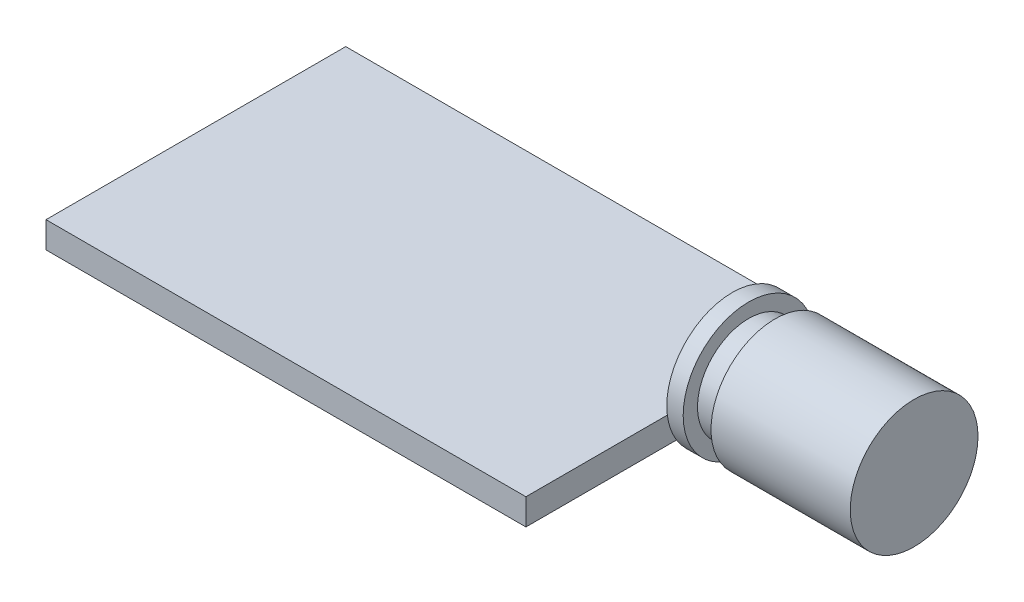
ISO-10303-21;
HEADER;
FILE_DESCRIPTION(('STEP AP214'),'2;1');
FILE_NAME('part.step','',(''),(''),'','','');
FILE_SCHEMA(('AUTOMOTIVE_DESIGN { 1 0 10303 214 1 1 1 1 }'));
ENDSEC;
DATA;
#1=APPLICATION_CONTEXT('core data for automotive mechanical design processes');
#2=APPLICATION_PROTOCOL_DEFINITION('international standard','automotive_design',2000,#1);
#3=PRODUCT_CONTEXT('',#1,'mechanical');
#4=PRODUCT('Part','Part','',(#3));
#5=PRODUCT_RELATED_PRODUCT_CATEGORY('part','',(#4));
#6=PRODUCT_DEFINITION_FORMATION('','',#4);
#7=PRODUCT_DEFINITION_CONTEXT('part definition',#1,'design');
#8=PRODUCT_DEFINITION('design','',#6,#7);
#9=PRODUCT_DEFINITION_SHAPE('','',#8);
#10=(LENGTH_UNIT() NAMED_UNIT(*) SI_UNIT(.MILLI.,.METRE.));
#11=(NAMED_UNIT(*) PLANE_ANGLE_UNIT() SI_UNIT($,.RADIAN.));
#12=(NAMED_UNIT(*) SI_UNIT($,.STERADIAN.) SOLID_ANGLE_UNIT());
#13=UNCERTAINTY_MEASURE_WITH_UNIT(LENGTH_MEASURE(1.E-05),#10,'distance_accuracy_value','');
#14=(GEOMETRIC_REPRESENTATION_CONTEXT(3) GLOBAL_UNCERTAINTY_ASSIGNED_CONTEXT((#13)) GLOBAL_UNIT_ASSIGNED_CONTEXT((#10,
#11,#12)) REPRESENTATION_CONTEXT('',''));
#15=CARTESIAN_POINT('',(0.,0.,0.));
#16=DIRECTION('',(0.,0.,1.));
#17=DIRECTION('',(1.,0.,0.));
#18=AXIS2_PLACEMENT_3D('',#15,#16,#17);
#19=CARTESIAN_POINT('',(30.3,2.1,-12.6));
#20=DIRECTION('',(1.,0.,0.));
#21=DIRECTION('',(0.,0.,-1.));
#22=AXIS2_PLACEMENT_3D('',#19,#20,#21);
#23=PLANE('',#22);
#24=CARTESIAN_POINT('',(30.3,2.1,-12.6));
#25=DIRECTION('',(1.,0.,0.));
#26=DIRECTION('',(0.,0.,-1.));
#27=AXIS2_PLACEMENT_3D('',#24,#25,#26);
#28=CIRCLE('',#27,4.);
#29=CARTESIAN_POINT('',(30.3,2.1,-16.6));
#30=VERTEX_POINT('',#29);
#31=EDGE_CURVE('E116',#30,#30,#28,.T.);
#32=ORIENTED_EDGE('',*,*,#31,.T.);
#33=EDGE_LOOP('',(#32));
#34=FACE_BOUND('',#33,.T.);
#35=CARTESIAN_POINT('',(30.3,2.1,-12.6));
#36=DIRECTION('',(1.,0.,0.));
#37=DIRECTION('',(0.,0.,-1.));
#38=AXIS2_PLACEMENT_3D('',#35,#36,#37);
#39=CIRCLE('',#38,3.125);
#40=CARTESIAN_POINT('',(30.3,2.1,-15.725));
#41=VERTEX_POINT('',#40);
#42=EDGE_CURVE('E274',#41,#41,#39,.T.);
#43=ORIENTED_EDGE('',*,*,#42,.F.);
#44=EDGE_LOOP('',(#43));
#45=FACE_BOUND('',#44,.T.);
#46=ADVANCED_FACE('F37',(#34,#45),#23,.T.);
#47=CARTESIAN_POINT('',(29.3,1.6,0.));
#48=DIRECTION('',(-1.,0.,0.));
#49=DIRECTION('',(0.,0.,1.));
#50=AXIS2_PLACEMENT_3D('',#47,#48,#49);
#51=PLANE('',#50);
#52=CARTESIAN_POINT('',(29.3,2.1,-12.6));
#53=DIRECTION('',(1.,0.,0.));
#54=DIRECTION('',(0.,0.,-1.));
#55=AXIS2_PLACEMENT_3D('',#52,#53,#54);
#56=CIRCLE('',#55,4.);
#57=CARTESIAN_POINT('',(29.3,1.6,-8.63137303340311));
#58=VERTEX_POINT('',#57);
#59=CARTESIAN_POINT('',(29.3,0.,-9.19559109389016));
#60=VERTEX_POINT('',#59);
#61=EDGE_CURVE('E47',#58,#60,#56,.T.);
#62=ORIENTED_EDGE('',*,*,#61,.F.);
#63=DIRECTION('',(0.,0.,-1.));
#64=VECTOR('',#63,1.);
#65=CARTESIAN_POINT('',(29.3,1.6,0.));
#66=LINE('',#65,#64);
#67=CARTESIAN_POINT('',(29.3,1.6,0.));
#68=VERTEX_POINT('',#67);
#69=EDGE_CURVE('E97',#68,#58,#66,.T.);
#70=ORIENTED_EDGE('',*,*,#69,.F.);
#71=DIRECTION('',(0.,-1.,0.));
#72=VECTOR('',#71,1.);
#73=CARTESIAN_POINT('',(29.3,1.6,0.));
#74=LINE('',#73,#72);
#75=CARTESIAN_POINT('',(29.3,0.,0.));
#76=VERTEX_POINT('',#75);
#77=EDGE_CURVE('E139',#68,#76,#74,.T.);
#78=ORIENTED_EDGE('',*,*,#77,.T.);
#79=DIRECTION('',(0.,0.,-1.));
#80=VECTOR('',#79,1.);
#81=CARTESIAN_POINT('',(29.3,0.,0.));
#82=LINE('',#81,#80);
#83=EDGE_CURVE('E133',#76,#60,#82,.T.);
#84=ORIENTED_EDGE('',*,*,#83,.T.);
#85=EDGE_LOOP('',(#62,#70,#78,#84));
#86=FACE_BOUND('',#85,.T.);
#87=ADVANCED_FACE('F154',(#86),#51,.F.);
#88=CARTESIAN_POINT('',(29.3,0.,-16.0044089061098));
#89=VERTEX_POINT('',#88);
#90=CARTESIAN_POINT('',(29.3,1.6,-16.5686269665969));
#91=VERTEX_POINT('',#90);
#92=EDGE_CURVE('E11',#89,#91,#56,.T.);
#93=ORIENTED_EDGE('',*,*,#92,.F.);
#94=CARTESIAN_POINT('',(29.3,0.,-18.3));
#95=VERTEX_POINT('',#94);
#96=EDGE_CURVE('E132',#89,#95,#82,.T.);
#97=ORIENTED_EDGE('',*,*,#96,.T.);
#98=DIRECTION('',(0.,-1.,0.));
#99=VECTOR('',#98,1.);
#100=CARTESIAN_POINT('',(29.3,1.6,-18.3));
#101=LINE('',#100,#99);
#102=CARTESIAN_POINT('',(29.3,1.6,-18.3));
#103=VERTEX_POINT('',#102);
#104=EDGE_CURVE('E104',#103,#95,#101,.T.);
#105=ORIENTED_EDGE('',*,*,#104,.F.);
#106=EDGE_CURVE('E95',#91,#103,#66,.T.);
#107=ORIENTED_EDGE('',*,*,#106,.F.);
#108=EDGE_LOOP('',(#93,#97,#105,#107));
#109=FACE_BOUND('',#108,.T.);
#110=ADVANCED_FACE('F102',(#109),#51,.F.);
#111=CARTESIAN_POINT('',(0.,1.6,0.));
#112=DIRECTION('',(1.,0.,0.));
#113=DIRECTION('',(0.,0.,-1.));
#114=AXIS2_PLACEMENT_3D('',#111,#112,#113);
#115=PLANE('',#114);
#116=DIRECTION('',(0.,0.,1.));
#117=VECTOR('',#116,1.);
#118=CARTESIAN_POINT('',(0.,0.,0.));
#119=LINE('',#118,#117);
#120=CARTESIAN_POINT('',(0.,0.,-18.3));
#121=VERTEX_POINT('',#120);
#122=CARTESIAN_POINT('',(0.,0.,0.));
#123=VERTEX_POINT('',#122);
#124=EDGE_CURVE('E127',#121,#123,#119,.T.);
#125=ORIENTED_EDGE('',*,*,#124,.T.);
#126=DIRECTION('',(0.,-1.,0.));
#127=VECTOR('',#126,1.);
#128=CARTESIAN_POINT('',(0.,1.6,0.));
#129=LINE('',#128,#127);
#130=CARTESIAN_POINT('',(0.,1.6,0.));
#131=VERTEX_POINT('',#130);
#132=EDGE_CURVE('E41',#131,#123,#129,.T.);
#133=ORIENTED_EDGE('',*,*,#132,.F.);
#134=DIRECTION('',(0.,0.,1.));
#135=VECTOR('',#134,1.);
#136=CARTESIAN_POINT('',(0.,1.6,0.));
#137=LINE('',#136,#135);
#138=CARTESIAN_POINT('',(0.,1.6,-18.3));
#139=VERTEX_POINT('',#138);
#140=EDGE_CURVE('E120',#139,#131,#137,.T.);
#141=ORIENTED_EDGE('',*,*,#140,.F.);
#142=DIRECTION('',(0.,-1.,0.));
#143=VECTOR('',#142,1.);
#144=CARTESIAN_POINT('',(0.,1.6,-18.3));
#145=LINE('',#144,#143);
#146=EDGE_CURVE('E126',#139,#121,#145,.T.);
#147=ORIENTED_EDGE('',*,*,#146,.T.);
#148=EDGE_LOOP('',(#125,#133,#141,#147));
#149=FACE_BOUND('',#148,.T.);
#150=ADVANCED_FACE('F39',(#149),#115,.F.);
#151=CARTESIAN_POINT('',(0.,1.6,0.));
#152=DIRECTION('',(0.,0.,-1.));
#153=DIRECTION('',(-1.,0.,0.));
#154=AXIS2_PLACEMENT_3D('',#151,#152,#153);
#155=PLANE('',#154);
#156=DIRECTION('',(1.,0.,0.));
#157=VECTOR('',#156,1.);
#158=CARTESIAN_POINT('',(0.,0.,0.));
#159=LINE('',#158,#157);
#160=EDGE_CURVE('E130',#123,#76,#159,.T.);
#161=ORIENTED_EDGE('',*,*,#160,.T.);
#162=ORIENTED_EDGE('',*,*,#77,.F.);
#163=DIRECTION('',(1.,0.,0.));
#164=VECTOR('',#163,1.);
#165=CARTESIAN_POINT('',(0.,1.6,0.));
#166=LINE('',#165,#164);
#167=EDGE_CURVE('E106',#131,#68,#166,.T.);
#168=ORIENTED_EDGE('',*,*,#167,.F.);
#169=ORIENTED_EDGE('',*,*,#132,.T.);
#170=EDGE_LOOP('',(#161,#162,#168,#169));
#171=FACE_BOUND('',#170,.T.);
#172=ADVANCED_FACE('F146',(#171),#155,.F.);
#173=CARTESIAN_POINT('',(0.,1.6,-18.3));
#174=DIRECTION('',(0.,0.,1.));
#175=DIRECTION('',(1.,0.,0.));
#176=AXIS2_PLACEMENT_3D('',#173,#174,#175);
#177=PLANE('',#176);
#178=DIRECTION('',(-1.,0.,0.));
#179=VECTOR('',#178,1.);
#180=CARTESIAN_POINT('',(0.,0.,-18.3));
#181=LINE('',#180,#179);
#182=EDGE_CURVE('E122',#95,#121,#181,.T.);
#183=ORIENTED_EDGE('',*,*,#182,.T.);
#184=ORIENTED_EDGE('',*,*,#146,.F.);
#185=DIRECTION('',(-1.,0.,0.));
#186=VECTOR('',#185,1.);
#187=CARTESIAN_POINT('',(0.,1.6,-18.3));
#188=LINE('',#187,#186);
#189=EDGE_CURVE('E124',#103,#139,#188,.T.);
#190=ORIENTED_EDGE('',*,*,#189,.F.);
#191=ORIENTED_EDGE('',*,*,#104,.T.);
#192=EDGE_LOOP('',(#183,#184,#190,#191));
#193=FACE_BOUND('',#192,.T.);
#194=ADVANCED_FACE('F164',(#193),#177,.F.);
#195=CARTESIAN_POINT('',(0.,1.6,-18.3));
#196=DIRECTION('',(0.,-1.,0.));
#197=DIRECTION('',(0.,0.,-1.));
#198=AXIS2_PLACEMENT_3D('',#195,#196,#197);
#199=PLANE('',#198);
#200=ORIENTED_EDGE('',*,*,#140,.T.);
#201=ORIENTED_EDGE('',*,*,#167,.T.);
#202=ORIENTED_EDGE('',*,*,#69,.T.);
#203=EDGE_CURVE('E92',#58,#91,#66,.T.);
#204=ORIENTED_EDGE('',*,*,#203,.T.);
#205=ORIENTED_EDGE('',*,*,#106,.T.);
#206=ORIENTED_EDGE('',*,*,#189,.T.);
#207=EDGE_LOOP('',(#200,#201,#202,#204,#205,#206));
#208=FACE_BOUND('',#207,.T.);
#209=ADVANCED_FACE('F94',(#208),#199,.F.);
#210=CARTESIAN_POINT('',(0.,0.,-18.3));
#211=DIRECTION('',(0.,-1.,0.));
#212=DIRECTION('',(0.,0.,-1.));
#213=AXIS2_PLACEMENT_3D('',#210,#211,#212);
#214=PLANE('',#213);
#215=ORIENTED_EDGE('',*,*,#124,.F.);
#216=ORIENTED_EDGE('',*,*,#182,.F.);
#217=ORIENTED_EDGE('',*,*,#96,.F.);
#218=EDGE_CURVE('E135',#60,#89,#82,.T.);
#219=ORIENTED_EDGE('',*,*,#218,.F.);
#220=ORIENTED_EDGE('',*,*,#83,.F.);
#221=ORIENTED_EDGE('',*,*,#160,.F.);
#222=EDGE_LOOP('',(#215,#216,#217,#219,#220,#221));
#223=FACE_BOUND('',#222,.T.);
#224=ADVANCED_FACE('F153',(#223),#214,.T.);
#225=CARTESIAN_POINT('',(29.3,2.1,-12.6));
#226=DIRECTION('',(1.,0.,0.));
#227=DIRECTION('',(0.,0.,-1.));
#228=AXIS2_PLACEMENT_3D('',#225,#226,#227);
#229=PLANE('',#228);
#230=EDGE_CURVE('E48',#60,#89,#56,.T.);
#231=ORIENTED_EDGE('',*,*,#230,.F.);
#232=ORIENTED_EDGE('',*,*,#218,.T.);
#233=EDGE_LOOP('',(#231,#232));
#234=FACE_BOUND('',#233,.T.);
#235=ADVANCED_FACE('F198',(#234),#229,.F.);
#236=CARTESIAN_POINT('',(30.3,2.1,-12.6));
#237=DIRECTION('',(-1.,0.,0.));
#238=DIRECTION('',(0.,0.,1.));
#239=AXIS2_PLACEMENT_3D('',#236,#237,#238);
#240=CYLINDRICAL_SURFACE('',#239,4.);
#241=ORIENTED_EDGE('',*,*,#31,.F.);
#242=EDGE_LOOP('',(#241));
#243=FACE_BOUND('',#242,.T.);
#244=ORIENTED_EDGE('',*,*,#61,.T.);
#245=ORIENTED_EDGE('',*,*,#230,.T.);
#246=ORIENTED_EDGE('',*,*,#92,.T.);
#247=EDGE_CURVE('E107',#91,#58,#56,.T.);
#248=ORIENTED_EDGE('',*,*,#247,.T.);
#249=EDGE_LOOP('',(#244,#245,#246,#248));
#250=FACE_BOUND('',#249,.T.);
#251=ADVANCED_FACE('F112',(#243,#250),#240,.T.);
#252=ORIENTED_EDGE('',*,*,#203,.F.);
#253=ORIENTED_EDGE('',*,*,#247,.F.);
#254=EDGE_LOOP('',(#252,#253));
#255=FACE_BOUND('',#254,.T.);
#256=ADVANCED_FACE('F108',(#255),#229,.F.);
#257=CARTESIAN_POINT('',(31.9,2.1,-12.6));
#258=DIRECTION('',(-1.,0.,0.));
#259=DIRECTION('',(0.,0.,1.));
#260=AXIS2_PLACEMENT_3D('',#257,#258,#259);
#261=CYLINDRICAL_SURFACE('',#260,3.125);
#262=CARTESIAN_POINT('',(31.9,2.1,-12.6));
#263=DIRECTION('',(1.,0.,0.));
#264=DIRECTION('',(0.,0.,-1.));
#265=AXIS2_PLACEMENT_3D('',#262,#263,#264);
#266=CIRCLE('',#265,3.125);
#267=CARTESIAN_POINT('',(31.9,2.1,-15.725));
#268=VERTEX_POINT('',#267);
#269=EDGE_CURVE('E110',#268,#268,#266,.T.);
#270=ORIENTED_EDGE('',*,*,#269,.F.);
#271=EDGE_LOOP('',(#270));
#272=FACE_BOUND('',#271,.T.);
#273=ORIENTED_EDGE('',*,*,#42,.T.);
#274=EDGE_LOOP('',(#273));
#275=FACE_BOUND('',#274,.T.);
#276=ADVANCED_FACE('F223',(#272,#275),#261,.T.);
#277=CARTESIAN_POINT('',(31.9,2.1,-12.6));
#278=DIRECTION('',(1.,0.,0.));
#279=DIRECTION('',(0.,0.,-1.));
#280=AXIS2_PLACEMENT_3D('',#277,#278,#279);
#281=PLANE('',#280);
#282=CARTESIAN_POINT('',(31.9,2.1,-12.6));
#283=DIRECTION('',(1.,0.,0.));
#284=DIRECTION('',(0.,0.,-1.));
#285=AXIS2_PLACEMENT_3D('',#282,#283,#284);
#286=CIRCLE('',#285,3.9);
#287=CARTESIAN_POINT('',(31.9,2.1,-16.5));
#288=VERTEX_POINT('',#287);
#289=EDGE_CURVE('E275',#288,#288,#286,.T.);
#290=ORIENTED_EDGE('',*,*,#289,.F.);
#291=EDGE_LOOP('',(#290));
#292=FACE_BOUND('',#291,.T.);
#293=ORIENTED_EDGE('',*,*,#269,.T.);
#294=EDGE_LOOP('',(#293));
#295=FACE_BOUND('',#294,.T.);
#296=ADVANCED_FACE('F237',(#292,#295),#281,.F.);
#297=CARTESIAN_POINT('',(40.4,2.1,-12.6));
#298=DIRECTION('',(-1.,0.,0.));
#299=DIRECTION('',(0.,0.,1.));
#300=AXIS2_PLACEMENT_3D('',#297,#298,#299);
#301=CYLINDRICAL_SURFACE('',#300,3.9);
#302=CARTESIAN_POINT('',(40.4,2.1,-12.6));
#303=DIRECTION('',(1.,0.,0.));
#304=DIRECTION('',(0.,0.,-1.));
#305=AXIS2_PLACEMENT_3D('',#302,#303,#304);
#306=CIRCLE('',#305,3.9);
#307=CARTESIAN_POINT('',(40.4,2.1,-16.5));
#308=VERTEX_POINT('',#307);
#309=EDGE_CURVE('E273',#308,#308,#306,.T.);
#310=ORIENTED_EDGE('',*,*,#309,.F.);
#311=EDGE_LOOP('',(#310));
#312=FACE_BOUND('',#311,.T.);
#313=ORIENTED_EDGE('',*,*,#289,.T.);
#314=EDGE_LOOP('',(#313));
#315=FACE_BOUND('',#314,.T.);
#316=ADVANCED_FACE('F247',(#312,#315),#301,.T.);
#317=CARTESIAN_POINT('',(40.4,2.1,-12.6));
#318=DIRECTION('',(1.,0.,0.));
#319=DIRECTION('',(0.,0.,-1.));
#320=AXIS2_PLACEMENT_3D('',#317,#318,#319);
#321=PLANE('',#320);
#322=ORIENTED_EDGE('',*,*,#309,.T.);
#323=EDGE_LOOP('',(#322));
#324=FACE_BOUND('',#323,.T.);
#325=ADVANCED_FACE('F257',(#324),#321,.T.);
#326=CLOSED_SHELL('',(#46,#87,#110,#150,#172,#194,#209,#224,#235,#251,#256,#276,#296,#316,#325));
#327=MANIFOLD_SOLID_BREP('B2',#326);
#328=ADVANCED_BREP_SHAPE_REPRESENTATION('',(#18,#327),#14);
#329=SHAPE_DEFINITION_REPRESENTATION(#9,#328);
ENDSEC;
END-ISO-10303-21;
